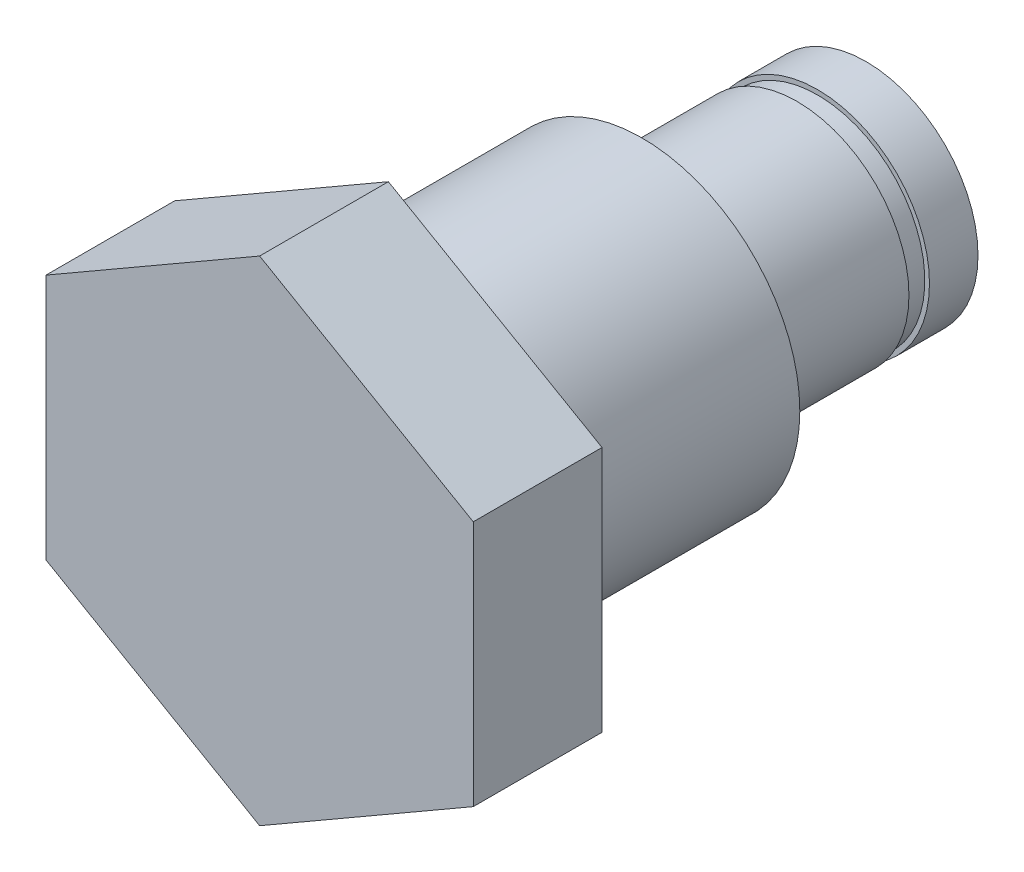
ISO-10303-21;
HEADER;
FILE_DESCRIPTION(('STEP AP214'),'2;1');
FILE_NAME('part.step','',(''),(''),'','','');
FILE_SCHEMA(('AUTOMOTIVE_DESIGN { 1 0 10303 214 1 1 1 1 }'));
ENDSEC;
DATA;
#1=APPLICATION_CONTEXT('core data for automotive mechanical design processes');
#2=APPLICATION_PROTOCOL_DEFINITION('international standard','automotive_design',2000,#1);
#3=PRODUCT_CONTEXT('',#1,'mechanical');
#4=PRODUCT('Part','Part','',(#3));
#5=PRODUCT_RELATED_PRODUCT_CATEGORY('part','',(#4));
#6=PRODUCT_DEFINITION_FORMATION('','',#4);
#7=PRODUCT_DEFINITION_CONTEXT('part definition',#1,'design');
#8=PRODUCT_DEFINITION('design','',#6,#7);
#9=PRODUCT_DEFINITION_SHAPE('','',#8);
#10=(LENGTH_UNIT() NAMED_UNIT(*) SI_UNIT(.MILLI.,.METRE.));
#11=(NAMED_UNIT(*) PLANE_ANGLE_UNIT() SI_UNIT($,.RADIAN.));
#12=(NAMED_UNIT(*) SI_UNIT($,.STERADIAN.) SOLID_ANGLE_UNIT());
#13=UNCERTAINTY_MEASURE_WITH_UNIT(LENGTH_MEASURE(1.E-05),#10,'distance_accuracy_value','');
#14=(GEOMETRIC_REPRESENTATION_CONTEXT(3) GLOBAL_UNCERTAINTY_ASSIGNED_CONTEXT((#13)) GLOBAL_UNIT_ASSIGNED_CONTEXT((#10,
#11,#12)) REPRESENTATION_CONTEXT('',''));
#15=CARTESIAN_POINT('',(0.,0.,0.));
#16=DIRECTION('',(0.,0.,1.));
#17=DIRECTION('',(1.,0.,0.));
#18=AXIS2_PLACEMENT_3D('',#15,#16,#17);
#19=CARTESIAN_POINT('',(0.,0.,-25.6));
#20=DIRECTION('',(0.,0.,1.));
#21=DIRECTION('',(1.,0.,0.));
#22=AXIS2_PLACEMENT_3D('',#19,#20,#21);
#23=CYLINDRICAL_SURFACE('',#22,6.);
#24=CARTESIAN_POINT('',(0.,0.,-13.6));
#25=DIRECTION('',(0.,0.,-1.));
#26=DIRECTION('',(-1.,0.,0.));
#27=AXIS2_PLACEMENT_3D('',#24,#25,#26);
#28=CIRCLE('',#27,6.);
#29=CARTESIAN_POINT('',(-6.,0.,-13.6));
#30=VERTEX_POINT('',#29);
#31=EDGE_CURVE('E11',#30,#30,#28,.T.);
#32=ORIENTED_EDGE('',*,*,#31,.T.);
#33=EDGE_LOOP('',(#32));
#34=FACE_BOUND('',#33,.T.);
#35=CARTESIAN_POINT('',(0.,0.,-21.9));
#36=DIRECTION('',(0.,0.,-1.));
#37=DIRECTION('',(-1.,0.,0.));
#38=AXIS2_PLACEMENT_3D('',#35,#36,#37);
#39=CIRCLE('',#38,6.);
#40=CARTESIAN_POINT('',(-6.,0.,-21.9));
#41=VERTEX_POINT('',#40);
#42=EDGE_CURVE('E187',#41,#41,#39,.T.);
#43=ORIENTED_EDGE('',*,*,#42,.F.);
#44=EDGE_LOOP('',(#43));
#45=FACE_BOUND('',#44,.T.);
#46=ADVANCED_FACE('F40',(#34,#45),#23,.T.);
#47=CARTESIAN_POINT('',(0.,0.,-13.6));
#48=DIRECTION('',(0.,0.,1.));
#49=DIRECTION('',(1.,0.,0.));
#50=AXIS2_PLACEMENT_3D('',#47,#48,#49);
#51=CYLINDRICAL_SURFACE('',#50,8.45);
#52=CARTESIAN_POINT('',(0.,0.,-13.6));
#53=DIRECTION('',(0.,0.,1.));
#54=DIRECTION('',(1.,0.,0.));
#55=AXIS2_PLACEMENT_3D('',#52,#53,#54);
#56=CIRCLE('',#55,8.45);
#57=CARTESIAN_POINT('',(8.45,0.,-13.6));
#58=VERTEX_POINT('',#57);
#59=EDGE_CURVE('E50',#58,#58,#56,.T.);
#60=ORIENTED_EDGE('',*,*,#59,.T.);
#61=EDGE_LOOP('',(#60));
#62=FACE_BOUND('',#61,.T.);
#63=CARTESIAN_POINT('',(0.,0.,0.));
#64=DIRECTION('',(0.,0.,1.));
#65=DIRECTION('',(1.,0.,0.));
#66=AXIS2_PLACEMENT_3D('',#63,#64,#65);
#67=CIRCLE('',#66,8.45);
#68=CARTESIAN_POINT('',(8.45,0.,0.));
#69=VERTEX_POINT('',#68);
#70=EDGE_CURVE('E44',#69,#69,#67,.T.);
#71=ORIENTED_EDGE('',*,*,#70,.F.);
#72=EDGE_LOOP('',(#71));
#73=FACE_BOUND('',#72,.T.);
#74=ADVANCED_FACE('F42',(#62,#73),#51,.T.);
#75=CARTESIAN_POINT('',(0.,0.,-13.6));
#76=DIRECTION('',(0.,0.,1.));
#77=DIRECTION('',(1.,0.,0.));
#78=AXIS2_PLACEMENT_3D('',#75,#76,#77);
#79=PLANE('',#78);
#80=ORIENTED_EDGE('',*,*,#31,.F.);
#81=EDGE_LOOP('',(#80));
#82=FACE_BOUND('',#81,.T.);
#83=ORIENTED_EDGE('',*,*,#59,.F.);
#84=EDGE_LOOP('',(#83));
#85=FACE_BOUND('',#84,.T.);
#86=ADVANCED_FACE('F157',(#82,#85),#79,.F.);
#87=CARTESIAN_POINT('',(11.45,6.61066058222123,6.9));
#88=DIRECTION('',(-0.5,-0.866025403784439,0.));
#89=DIRECTION('',(0.866025403784439,-0.5,0.));
#90=AXIS2_PLACEMENT_3D('',#87,#88,#89);
#91=PLANE('',#90);
#92=DIRECTION('',(-0.866025403784439,0.5,0.));
#93=VECTOR('',#92,1.);
#94=CARTESIAN_POINT('',(11.45,6.61066058222123,0.));
#95=LINE('',#94,#93);
#96=CARTESIAN_POINT('',(11.45,6.61066058222123,0.));
#97=VERTEX_POINT('',#96);
#98=CARTESIAN_POINT('',(0.,13.2213211644424,0.));
#99=VERTEX_POINT('',#98);
#100=EDGE_CURVE('E128',#97,#99,#95,.T.);
#101=ORIENTED_EDGE('',*,*,#100,.T.);
#102=DIRECTION('',(0.,0.,-1.));
#103=VECTOR('',#102,1.);
#104=CARTESIAN_POINT('',(0.,13.2213211644424,6.9));
#105=LINE('',#104,#103);
#106=CARTESIAN_POINT('',(0.,13.2213211644424,6.9));
#107=VERTEX_POINT('',#106);
#108=EDGE_CURVE('E146',#107,#99,#105,.T.);
#109=ORIENTED_EDGE('',*,*,#108,.F.);
#110=DIRECTION('',(-0.866025403784439,0.5,0.));
#111=VECTOR('',#110,1.);
#112=CARTESIAN_POINT('',(11.45,6.61066058222123,6.9));
#113=LINE('',#112,#111);
#114=CARTESIAN_POINT('',(11.45,6.61066058222123,6.9));
#115=VERTEX_POINT('',#114);
#116=EDGE_CURVE('E139',#115,#107,#113,.T.);
#117=ORIENTED_EDGE('',*,*,#116,.F.);
#118=DIRECTION('',(0.,0.,-1.));
#119=VECTOR('',#118,1.);
#120=CARTESIAN_POINT('',(11.45,6.61066058222123,6.9));
#121=LINE('',#120,#119);
#122=EDGE_CURVE('E124',#115,#97,#121,.T.);
#123=ORIENTED_EDGE('',*,*,#122,.T.);
#124=EDGE_LOOP('',(#101,#109,#117,#123));
#125=FACE_BOUND('',#124,.T.);
#126=ADVANCED_FACE('F162',(#125),#91,.F.);
#127=CARTESIAN_POINT('',(0.,13.2213211644424,6.9));
#128=DIRECTION('',(0.5,-0.866025403784439,0.));
#129=DIRECTION('',(0.866025403784439,0.5,0.));
#130=AXIS2_PLACEMENT_3D('',#127,#128,#129);
#131=PLANE('',#130);
#132=DIRECTION('',(-0.866025403784438,-0.5,0.));
#133=VECTOR('',#132,1.);
#134=CARTESIAN_POINT('',(0.,13.2213211644424,0.));
#135=LINE('',#134,#133);
#136=CARTESIAN_POINT('',(-11.45,6.61066058222121,0.));
#137=VERTEX_POINT('',#136);
#138=EDGE_CURVE('E131',#99,#137,#135,.T.);
#139=ORIENTED_EDGE('',*,*,#138,.T.);
#140=DIRECTION('',(0.,0.,-1.));
#141=VECTOR('',#140,1.);
#142=CARTESIAN_POINT('',(-11.45,6.61066058222121,6.9));
#143=LINE('',#142,#141);
#144=CARTESIAN_POINT('',(-11.45,6.61066058222121,6.9));
#145=VERTEX_POINT('',#144);
#146=EDGE_CURVE('E143',#145,#137,#143,.T.);
#147=ORIENTED_EDGE('',*,*,#146,.F.);
#148=DIRECTION('',(-0.866025403784438,-0.5,0.));
#149=VECTOR('',#148,1.);
#150=CARTESIAN_POINT('',(0.,13.2213211644424,6.9));
#151=LINE('',#150,#149);
#152=EDGE_CURVE('E97',#107,#145,#151,.T.);
#153=ORIENTED_EDGE('',*,*,#152,.F.);
#154=ORIENTED_EDGE('',*,*,#108,.T.);
#155=EDGE_LOOP('',(#139,#147,#153,#154));
#156=FACE_BOUND('',#155,.T.);
#157=ADVANCED_FACE('F194',(#156),#131,.F.);
#158=CARTESIAN_POINT('',(-11.45,6.61066058222121,6.9));
#159=DIRECTION('',(1.,0.,0.));
#160=DIRECTION('',(0.,1.,0.));
#161=AXIS2_PLACEMENT_3D('',#158,#159,#160);
#162=PLANE('',#161);
#163=DIRECTION('',(0.,-1.,0.));
#164=VECTOR('',#163,1.);
#165=CARTESIAN_POINT('',(-11.45,6.61066058222121,0.));
#166=LINE('',#165,#164);
#167=CARTESIAN_POINT('',(-11.45,-6.61066058222122,0.));
#168=VERTEX_POINT('',#167);
#169=EDGE_CURVE('E134',#137,#168,#166,.T.);
#170=ORIENTED_EDGE('',*,*,#169,.T.);
#171=DIRECTION('',(0.,0.,-1.));
#172=VECTOR('',#171,1.);
#173=CARTESIAN_POINT('',(-11.45,-6.61066058222122,6.9));
#174=LINE('',#173,#172);
#175=CARTESIAN_POINT('',(-11.45,-6.61066058222122,6.9));
#176=VERTEX_POINT('',#175);
#177=EDGE_CURVE('E119',#176,#168,#174,.T.);
#178=ORIENTED_EDGE('',*,*,#177,.F.);
#179=DIRECTION('',(0.,-1.,0.));
#180=VECTOR('',#179,1.);
#181=CARTESIAN_POINT('',(-11.45,6.61066058222121,6.9));
#182=LINE('',#181,#180);
#183=EDGE_CURVE('E110',#145,#176,#182,.T.);
#184=ORIENTED_EDGE('',*,*,#183,.F.);
#185=ORIENTED_EDGE('',*,*,#146,.T.);
#186=EDGE_LOOP('',(#170,#178,#184,#185));
#187=FACE_BOUND('',#186,.T.);
#188=ADVANCED_FACE('F197',(#187),#162,.F.);
#189=CARTESIAN_POINT('',(-11.45,-6.61066058222122,6.9));
#190=DIRECTION('',(0.5,0.866025403784439,0.));
#191=DIRECTION('',(-0.866025403784439,0.5,0.));
#192=AXIS2_PLACEMENT_3D('',#189,#190,#191);
#193=PLANE('',#192);
#194=DIRECTION('',(0.866025403784439,-0.5,0.));
#195=VECTOR('',#194,1.);
#196=CARTESIAN_POINT('',(-11.45,-6.61066058222122,0.));
#197=LINE('',#196,#195);
#198=CARTESIAN_POINT('',(0.,-13.2213211644424,0.));
#199=VERTEX_POINT('',#198);
#200=EDGE_CURVE('E118',#168,#199,#197,.T.);
#201=ORIENTED_EDGE('',*,*,#200,.T.);
#202=DIRECTION('',(0.,0.,-1.));
#203=VECTOR('',#202,1.);
#204=CARTESIAN_POINT('',(0.,-13.2213211644424,6.9));
#205=LINE('',#204,#203);
#206=CARTESIAN_POINT('',(0.,-13.2213211644424,6.9));
#207=VERTEX_POINT('',#206);
#208=EDGE_CURVE('E115',#207,#199,#205,.T.);
#209=ORIENTED_EDGE('',*,*,#208,.F.);
#210=DIRECTION('',(0.866025403784439,-0.5,0.));
#211=VECTOR('',#210,1.);
#212=CARTESIAN_POINT('',(-11.45,-6.61066058222122,6.9));
#213=LINE('',#212,#211);
#214=EDGE_CURVE('E104',#176,#207,#213,.T.);
#215=ORIENTED_EDGE('',*,*,#214,.F.);
#216=ORIENTED_EDGE('',*,*,#177,.T.);
#217=EDGE_LOOP('',(#201,#209,#215,#216));
#218=FACE_BOUND('',#217,.T.);
#219=ADVANCED_FACE('F116',(#218),#193,.F.);
#220=CARTESIAN_POINT('',(0.,-13.2213211644424,6.9));
#221=DIRECTION('',(-0.5,0.866025403784439,0.));
#222=DIRECTION('',(-0.866025403784439,-0.5,0.));
#223=AXIS2_PLACEMENT_3D('',#220,#221,#222);
#224=PLANE('',#223);
#225=DIRECTION('',(0.866025403784439,0.5,0.));
#226=VECTOR('',#225,1.);
#227=CARTESIAN_POINT('',(0.,-13.2213211644424,0.));
#228=LINE('',#227,#226);
#229=CARTESIAN_POINT('',(11.45,-6.61066058222122,0.));
#230=VERTEX_POINT('',#229);
#231=EDGE_CURVE('E82',#199,#230,#228,.T.);
#232=ORIENTED_EDGE('',*,*,#231,.T.);
#233=DIRECTION('',(0.,0.,-1.));
#234=VECTOR('',#233,1.);
#235=CARTESIAN_POINT('',(11.45,-6.61066058222122,6.9));
#236=LINE('',#235,#234);
#237=CARTESIAN_POINT('',(11.45,-6.61066058222122,6.9));
#238=VERTEX_POINT('',#237);
#239=EDGE_CURVE('E120',#238,#230,#236,.T.);
#240=ORIENTED_EDGE('',*,*,#239,.F.);
#241=DIRECTION('',(0.866025403784439,0.5,0.));
#242=VECTOR('',#241,1.);
#243=CARTESIAN_POINT('',(0.,-13.2213211644424,6.9));
#244=LINE('',#243,#242);
#245=EDGE_CURVE('E108',#207,#238,#244,.T.);
#246=ORIENTED_EDGE('',*,*,#245,.F.);
#247=ORIENTED_EDGE('',*,*,#208,.T.);
#248=EDGE_LOOP('',(#232,#240,#246,#247));
#249=FACE_BOUND('',#248,.T.);
#250=ADVANCED_FACE('F122',(#249),#224,.F.);
#251=CARTESIAN_POINT('',(11.45,-6.61066058222122,6.9));
#252=DIRECTION('',(-1.,0.,0.));
#253=DIRECTION('',(0.,-1.,0.));
#254=AXIS2_PLACEMENT_3D('',#251,#252,#253);
#255=PLANE('',#254);
#256=DIRECTION('',(0.,1.,0.));
#257=VECTOR('',#256,1.);
#258=CARTESIAN_POINT('',(11.45,-6.61066058222122,0.));
#259=LINE('',#258,#257);
#260=EDGE_CURVE('E88',#230,#97,#259,.T.);
#261=ORIENTED_EDGE('',*,*,#260,.T.);
#262=ORIENTED_EDGE('',*,*,#122,.F.);
#263=DIRECTION('',(0.,1.,0.));
#264=VECTOR('',#263,1.);
#265=CARTESIAN_POINT('',(11.45,-6.61066058222122,6.9));
#266=LINE('',#265,#264);
#267=EDGE_CURVE('E59',#238,#115,#266,.T.);
#268=ORIENTED_EDGE('',*,*,#267,.F.);
#269=ORIENTED_EDGE('',*,*,#239,.T.);
#270=EDGE_LOOP('',(#261,#262,#268,#269));
#271=FACE_BOUND('',#270,.T.);
#272=ADVANCED_FACE('F200',(#271),#255,.F.);
#273=CARTESIAN_POINT('',(0.,0.,6.9));
#274=DIRECTION('',(0.,0.,1.));
#275=DIRECTION('',(1.,0.,0.));
#276=AXIS2_PLACEMENT_3D('',#273,#274,#275);
#277=PLANE('',#276);
#278=ORIENTED_EDGE('',*,*,#116,.T.);
#279=ORIENTED_EDGE('',*,*,#152,.T.);
#280=ORIENTED_EDGE('',*,*,#183,.T.);
#281=ORIENTED_EDGE('',*,*,#214,.T.);
#282=ORIENTED_EDGE('',*,*,#245,.T.);
#283=ORIENTED_EDGE('',*,*,#267,.T.);
#284=EDGE_LOOP('',(#278,#279,#280,#281,#282,#283));
#285=FACE_BOUND('',#284,.T.);
#286=ADVANCED_FACE('F106',(#285),#277,.T.);
#287=CARTESIAN_POINT('',(0.,0.,0.));
#288=DIRECTION('',(0.,0.,1.));
#289=DIRECTION('',(1.,0.,0.));
#290=AXIS2_PLACEMENT_3D('',#287,#288,#289);
#291=PLANE('',#290);
#292=ORIENTED_EDGE('',*,*,#70,.T.);
#293=EDGE_LOOP('',(#292));
#294=FACE_BOUND('',#293,.T.);
#295=ORIENTED_EDGE('',*,*,#100,.F.);
#296=ORIENTED_EDGE('',*,*,#260,.F.);
#297=ORIENTED_EDGE('',*,*,#231,.F.);
#298=ORIENTED_EDGE('',*,*,#200,.F.);
#299=ORIENTED_EDGE('',*,*,#169,.F.);
#300=ORIENTED_EDGE('',*,*,#138,.F.);
#301=EDGE_LOOP('',(#295,#296,#297,#298,#299,#300));
#302=FACE_BOUND('',#301,.T.);
#303=ADVANCED_FACE('F153',(#294,#302),#291,.F.);
#304=CARTESIAN_POINT('',(0.,0.,-23.));
#305=DIRECTION('',(0.,0.,-1.));
#306=DIRECTION('',(-1.,0.,0.));
#307=AXIS2_PLACEMENT_3D('',#304,#305,#306);
#308=PLANE('',#307);
#309=CARTESIAN_POINT('',(0.,0.,-23.));
#310=DIRECTION('',(0.,0.,-1.));
#311=DIRECTION('',(-1.,0.,0.));
#312=AXIS2_PLACEMENT_3D('',#309,#310,#311);
#313=CIRCLE('',#312,6.);
#314=CARTESIAN_POINT('',(-6.,0.,-23.));
#315=VERTEX_POINT('',#314);
#316=EDGE_CURVE('E183',#315,#315,#313,.T.);
#317=ORIENTED_EDGE('',*,*,#316,.F.);
#318=EDGE_LOOP('',(#317));
#319=FACE_BOUND('',#318,.T.);
#320=CARTESIAN_POINT('',(0.,0.,-23.));
#321=DIRECTION('',(0.,0.,-1.));
#322=DIRECTION('',(-1.,0.,0.));
#323=AXIS2_PLACEMENT_3D('',#320,#321,#322);
#324=CIRCLE('',#323,5.75);
#325=CARTESIAN_POINT('',(-5.75,0.,-23.));
#326=VERTEX_POINT('',#325);
#327=EDGE_CURVE('E309',#326,#326,#324,.T.);
#328=ORIENTED_EDGE('',*,*,#327,.T.);
#329=EDGE_LOOP('',(#328));
#330=FACE_BOUND('',#329,.T.);
#331=ADVANCED_FACE('F255',(#319,#330),#308,.F.);
#332=CARTESIAN_POINT('',(0.,0.,-21.9));
#333=DIRECTION('',(0.,0.,-1.));
#334=DIRECTION('',(-1.,0.,0.));
#335=AXIS2_PLACEMENT_3D('',#332,#333,#334);
#336=PLANE('',#335);
#337=ORIENTED_EDGE('',*,*,#42,.T.);
#338=EDGE_LOOP('',(#337));
#339=FACE_BOUND('',#338,.T.);
#340=CARTESIAN_POINT('',(0.,0.,-21.9));
#341=DIRECTION('',(0.,0.,-1.));
#342=DIRECTION('',(-1.,0.,0.));
#343=AXIS2_PLACEMENT_3D('',#340,#341,#342);
#344=CIRCLE('',#343,5.75);
#345=CARTESIAN_POINT('',(-5.75,0.,-21.9));
#346=VERTEX_POINT('',#345);
#347=EDGE_CURVE('E312',#346,#346,#344,.T.);
#348=ORIENTED_EDGE('',*,*,#347,.F.);
#349=EDGE_LOOP('',(#348));
#350=FACE_BOUND('',#349,.T.);
#351=ADVANCED_FACE('F281',(#339,#350),#336,.T.);
#352=CARTESIAN_POINT('',(0.,0.,-23.));
#353=DIRECTION('',(0.,0.,1.));
#354=DIRECTION('',(1.,0.,0.));
#355=AXIS2_PLACEMENT_3D('',#352,#353,#354);
#356=CYLINDRICAL_SURFACE('',#355,5.75);
#357=ORIENTED_EDGE('',*,*,#327,.F.);
#358=EDGE_LOOP('',(#357));
#359=FACE_BOUND('',#358,.T.);
#360=ORIENTED_EDGE('',*,*,#347,.T.);
#361=EDGE_LOOP('',(#360));
#362=FACE_BOUND('',#361,.T.);
#363=ADVANCED_FACE('F178',(#359,#362),#356,.T.);
#364=CARTESIAN_POINT('',(0.,0.,-25.6));
#365=DIRECTION('',(0.,0.,-1.));
#366=DIRECTION('',(-1.,0.,0.));
#367=AXIS2_PLACEMENT_3D('',#364,#365,#366);
#368=PLANE('',#367);
#369=CARTESIAN_POINT('',(0.,0.,-25.6));
#370=DIRECTION('',(0.,0.,-1.));
#371=DIRECTION('',(-1.,0.,0.));
#372=AXIS2_PLACEMENT_3D('',#369,#370,#371);
#373=CIRCLE('',#372,6.);
#374=CARTESIAN_POINT('',(-6.,0.,-25.6));
#375=VERTEX_POINT('',#374);
#376=EDGE_CURVE('E132',#375,#375,#373,.T.);
#377=ORIENTED_EDGE('',*,*,#376,.T.);
#378=EDGE_LOOP('',(#377));
#379=FACE_BOUND('',#378,.T.);
#380=ADVANCED_FACE('F173',(#379),#368,.T.);
#381=ORIENTED_EDGE('',*,*,#316,.T.);
#382=EDGE_LOOP('',(#381));
#383=FACE_BOUND('',#382,.T.);
#384=ORIENTED_EDGE('',*,*,#376,.F.);
#385=EDGE_LOOP('',(#384));
#386=FACE_BOUND('',#385,.T.);
#387=ADVANCED_FACE('F166',(#383,#386),#23,.T.);
#388=CLOSED_SHELL('',(#46,#74,#86,#126,#157,#188,#219,#250,#272,#286,#303,#331,#351,#363,#380,#387));
#389=MANIFOLD_SOLID_BREP('B2',#388);
#390=ADVANCED_BREP_SHAPE_REPRESENTATION('',(#18,#389),#14);
#391=SHAPE_DEFINITION_REPRESENTATION(#9,#390);
ENDSEC;
END-ISO-10303-21;
